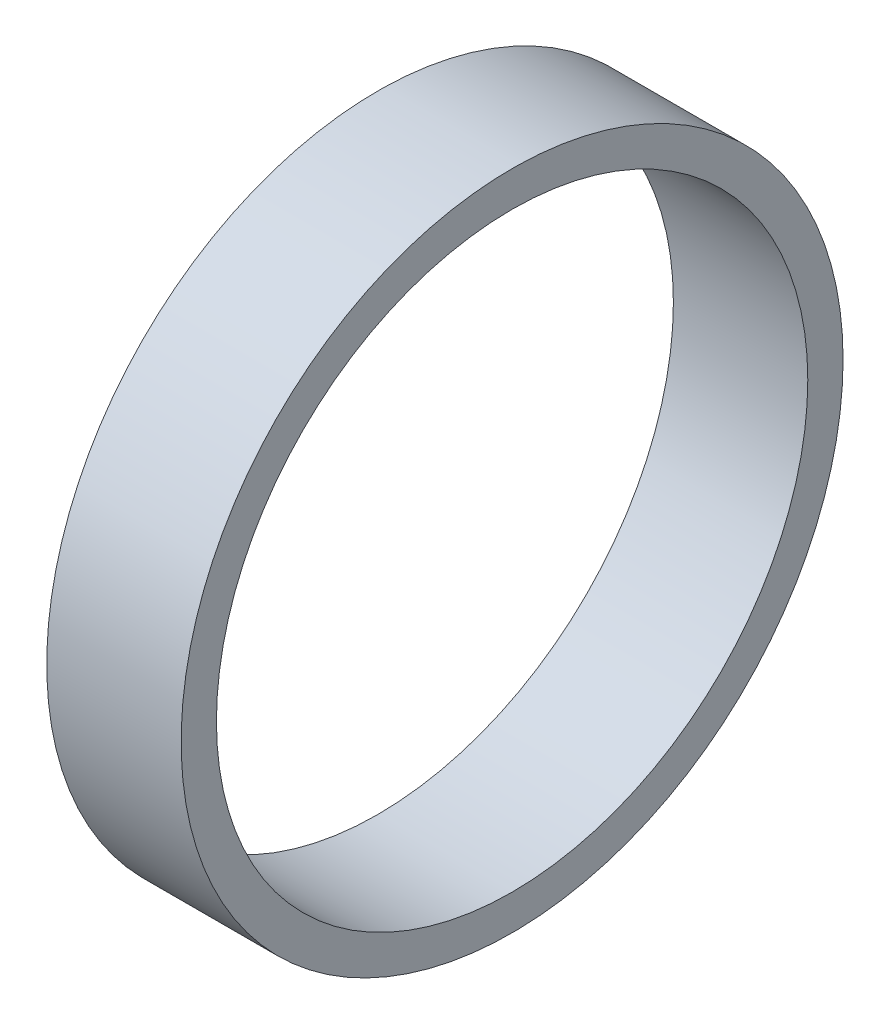
ISO-10303-21;
HEADER;
FILE_DESCRIPTION(('STEP AP214'),'2;1');
FILE_NAME('part.step','',(''),(''),'','','');
FILE_SCHEMA(('AUTOMOTIVE_DESIGN { 1 0 10303 214 1 1 1 1 }'));
ENDSEC;
DATA;
#1=APPLICATION_CONTEXT('core data for automotive mechanical design processes');
#2=APPLICATION_PROTOCOL_DEFINITION('international standard','automotive_design',2000,#1);
#3=PRODUCT_CONTEXT('',#1,'mechanical');
#4=PRODUCT('Part','Part','',(#3));
#5=PRODUCT_RELATED_PRODUCT_CATEGORY('part','',(#4));
#6=PRODUCT_DEFINITION_FORMATION('','',#4);
#7=PRODUCT_DEFINITION_CONTEXT('part definition',#1,'design');
#8=PRODUCT_DEFINITION('design','',#6,#7);
#9=PRODUCT_DEFINITION_SHAPE('','',#8);
#10=(LENGTH_UNIT() NAMED_UNIT(*) SI_UNIT(.MILLI.,.METRE.));
#11=(NAMED_UNIT(*) PLANE_ANGLE_UNIT() SI_UNIT($,.RADIAN.));
#12=(NAMED_UNIT(*) SI_UNIT($,.STERADIAN.) SOLID_ANGLE_UNIT());
#13=UNCERTAINTY_MEASURE_WITH_UNIT(LENGTH_MEASURE(1.E-05),#10,'distance_accuracy_value','');
#14=(GEOMETRIC_REPRESENTATION_CONTEXT(3) GLOBAL_UNCERTAINTY_ASSIGNED_CONTEXT((#13)) GLOBAL_UNIT_ASSIGNED_CONTEXT((#10,
#11,#12)) REPRESENTATION_CONTEXT('',''));
#15=CARTESIAN_POINT('',(0.,0.,0.));
#16=DIRECTION('',(0.,0.,1.));
#17=DIRECTION('',(1.,0.,0.));
#18=AXIS2_PLACEMENT_3D('',#15,#16,#17);
#19=CARTESIAN_POINT('',(2.,0.,0.));
#20=DIRECTION('',(1.,0.,0.));
#21=DIRECTION('',(0.,0.,-1.));
#22=AXIS2_PLACEMENT_3D('',#19,#20,#21);
#23=PLANE('',#22);
#24=CARTESIAN_POINT('',(2.,0.,0.));
#25=DIRECTION('',(1.,0.,0.));
#26=DIRECTION('',(0.,0.,-1.));
#27=AXIS2_PLACEMENT_3D('',#24,#25,#26);
#28=CIRCLE('',#27,4.925);
#29=CARTESIAN_POINT('',(2.,0.,-4.925));
#30=VERTEX_POINT('',#29);
#31=EDGE_CURVE('E10',#30,#30,#28,.T.);
#32=ORIENTED_EDGE('',*,*,#31,.T.);
#33=EDGE_LOOP('',(#32));
#34=FACE_BOUND('',#33,.T.);
#35=CARTESIAN_POINT('',(2.,0.,0.));
#36=DIRECTION('',(1.,0.,0.));
#37=DIRECTION('',(0.,0.,-1.));
#38=AXIS2_PLACEMENT_3D('',#35,#36,#37);
#39=CIRCLE('',#38,4.4);
#40=CARTESIAN_POINT('',(2.,0.,-4.4));
#41=VERTEX_POINT('',#40);
#42=EDGE_CURVE('E44',#41,#41,#39,.T.);
#43=ORIENTED_EDGE('',*,*,#42,.F.);
#44=EDGE_LOOP('',(#43));
#45=FACE_BOUND('',#44,.T.);
#46=ADVANCED_FACE('F33',(#34,#45),#23,.T.);
#47=CARTESIAN_POINT('',(0.,0.,0.));
#48=DIRECTION('',(1.,0.,0.));
#49=DIRECTION('',(0.,0.,-1.));
#50=AXIS2_PLACEMENT_3D('',#47,#48,#49);
#51=PLANE('',#50);
#52=CARTESIAN_POINT('',(0.,0.,0.));
#53=DIRECTION('',(1.,0.,0.));
#54=DIRECTION('',(0.,0.,-1.));
#55=AXIS2_PLACEMENT_3D('',#52,#53,#54);
#56=CIRCLE('',#55,4.925);
#57=CARTESIAN_POINT('',(0.,0.,-4.925));
#58=VERTEX_POINT('',#57);
#59=EDGE_CURVE('E37',#58,#58,#56,.T.);
#60=ORIENTED_EDGE('',*,*,#59,.F.);
#61=EDGE_LOOP('',(#60));
#62=FACE_BOUND('',#61,.T.);
#63=CARTESIAN_POINT('',(0.,0.,0.));
#64=DIRECTION('',(1.,0.,0.));
#65=DIRECTION('',(0.,0.,-1.));
#66=AXIS2_PLACEMENT_3D('',#63,#64,#65);
#67=CIRCLE('',#66,4.4);
#68=CARTESIAN_POINT('',(0.,0.,-4.4));
#69=VERTEX_POINT('',#68);
#70=EDGE_CURVE('E46',#69,#69,#67,.T.);
#71=ORIENTED_EDGE('',*,*,#70,.T.);
#72=EDGE_LOOP('',(#71));
#73=FACE_BOUND('',#72,.T.);
#74=ADVANCED_FACE('F56',(#62,#73),#51,.F.);
#75=CARTESIAN_POINT('',(2.,0.,0.));
#76=DIRECTION('',(-1.,0.,0.));
#77=DIRECTION('',(0.,0.,1.));
#78=AXIS2_PLACEMENT_3D('',#75,#76,#77);
#79=CYLINDRICAL_SURFACE('',#78,4.925);
#80=ORIENTED_EDGE('',*,*,#31,.F.);
#81=EDGE_LOOP('',(#80));
#82=FACE_BOUND('',#81,.T.);
#83=ORIENTED_EDGE('',*,*,#59,.T.);
#84=EDGE_LOOP('',(#83));
#85=FACE_BOUND('',#84,.T.);
#86=ADVANCED_FACE('F35',(#82,#85),#79,.T.);
#87=CARTESIAN_POINT('',(2.,0.,0.));
#88=DIRECTION('',(-1.,0.,0.));
#89=DIRECTION('',(0.,0.,1.));
#90=AXIS2_PLACEMENT_3D('',#87,#88,#89);
#91=CYLINDRICAL_SURFACE('',#90,4.4);
#92=ORIENTED_EDGE('',*,*,#42,.T.);
#93=EDGE_LOOP('',(#92));
#94=FACE_BOUND('',#93,.T.);
#95=ORIENTED_EDGE('',*,*,#70,.F.);
#96=EDGE_LOOP('',(#95));
#97=FACE_BOUND('',#96,.T.);
#98=ADVANCED_FACE('F52',(#94,#97),#91,.F.);
#99=CLOSED_SHELL('',(#46,#74,#86,#98));
#100=MANIFOLD_SOLID_BREP('B2',#99);
#101=ADVANCED_BREP_SHAPE_REPRESENTATION('',(#18,#100),#14);
#102=SHAPE_DEFINITION_REPRESENTATION(#9,#101);
ENDSEC;
END-ISO-10303-21;
